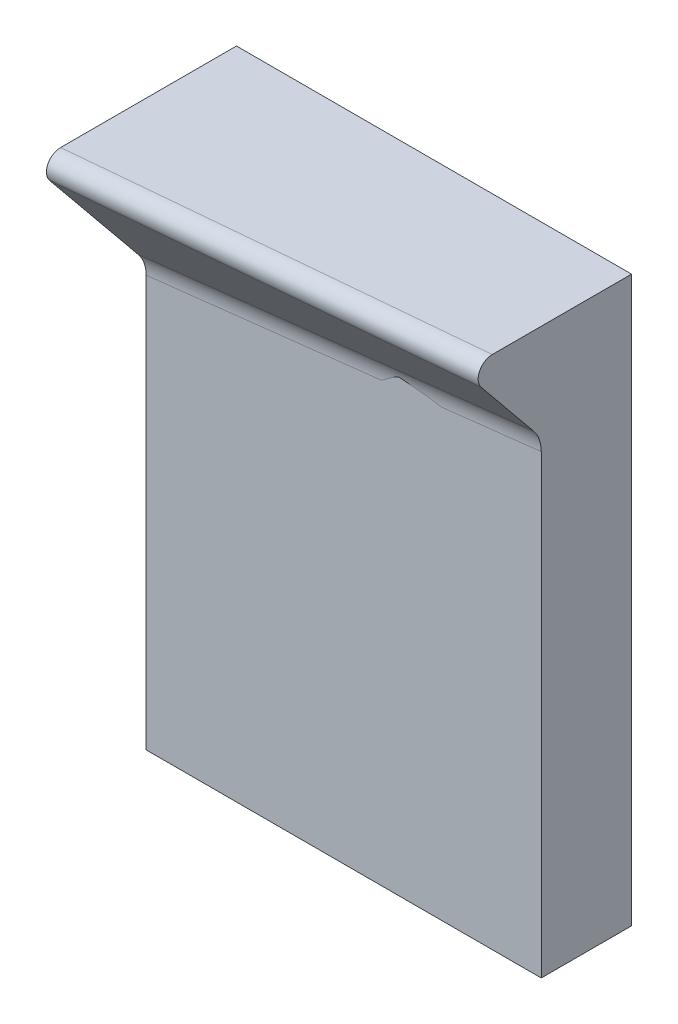
ISO-10303-21;
HEADER;
FILE_DESCRIPTION(('STEP AP214'),'2;1');
FILE_NAME('part.step','',(''),(''),'','','');
FILE_SCHEMA(('AUTOMOTIVE_DESIGN { 1 0 10303 214 1 1 1 1 }'));
ENDSEC;
DATA;
#1=APPLICATION_CONTEXT('core data for automotive mechanical design processes');
#2=APPLICATION_PROTOCOL_DEFINITION('international standard','automotive_design',2000,#1);
#3=PRODUCT_CONTEXT('',#1,'mechanical');
#4=PRODUCT('Part','Part','',(#3));
#5=PRODUCT_RELATED_PRODUCT_CATEGORY('part','',(#4));
#6=PRODUCT_DEFINITION_FORMATION('','',#4);
#7=PRODUCT_DEFINITION_CONTEXT('part definition',#1,'design');
#8=PRODUCT_DEFINITION('design','',#6,#7);
#9=PRODUCT_DEFINITION_SHAPE('','',#8);
#10=(LENGTH_UNIT() NAMED_UNIT(*) SI_UNIT(.MILLI.,.METRE.));
#11=(NAMED_UNIT(*) PLANE_ANGLE_UNIT() SI_UNIT($,.RADIAN.));
#12=(NAMED_UNIT(*) SI_UNIT($,.STERADIAN.) SOLID_ANGLE_UNIT());
#13=UNCERTAINTY_MEASURE_WITH_UNIT(LENGTH_MEASURE(1.E-05),#10,'distance_accuracy_value','');
#14=(GEOMETRIC_REPRESENTATION_CONTEXT(3) GLOBAL_UNCERTAINTY_ASSIGNED_CONTEXT((#13)) GLOBAL_UNIT_ASSIGNED_CONTEXT((#10,
#11,#12)) REPRESENTATION_CONTEXT('',''));
#15=CARTESIAN_POINT('',(0.,0.,0.));
#16=DIRECTION('',(0.,0.,1.));
#17=DIRECTION('',(1.,0.,0.));
#18=AXIS2_PLACEMENT_3D('',#15,#16,#17);
#19=CARTESIAN_POINT('',(-33.1458358214164,49.8380627497857,44.));
#20=DIRECTION('',(-0.993631308587486,-0.112680178357692,0.));
#21=DIRECTION('',(-0.0715823175561208,0.631223990782389,-0.772290259730142));
#22=AXIS2_PLACEMENT_3D('',#19,#20,#21);
#23=CYLINDRICAL_SURFACE('',#22,12.);
#24=CARTESIAN_POINT('',(13.3705485885876,55.1131325332905,44.));
#25=DIRECTION('',(0.588639923655362,-0.808395348996399,0.));
#26=DIRECTION('',(-0.808395348996399,-0.588639923655362,0.));
#27=AXIS2_PLACEMENT_3D('',#24,#25,#26);
#28=ELLIPSE('',#27,24.3012910260578,12.);
#29=CARTESIAN_POINT('',(13.3705485885876,55.1131325332905,32.));
#30=VERTEX_POINT('',#29);
#31=CARTESIAN_POINT('',(19.2154916356902,59.3691773426622,32.5434410649574));
#32=VERTEX_POINT('',#31);
#33=EDGE_CURVE('E400',#30,#32,#28,.T.);
#34=ORIENTED_EDGE('',*,*,#33,.T.);
#35=CARTESIAN_POINT('',(19.2154916356902,59.3691773426622,32.5434410649574));
#36=CARTESIAN_POINT('',(19.2588992136403,59.4007835589087,32.551704639562));
#37=CARTESIAN_POINT('',(19.3036206998502,59.4306722230316,32.5594894096215));
#38=CARTESIAN_POINT('',(19.3954623281207,59.4868250412178,32.5739747576308));
#39=CARTESIAN_POINT('',(19.4425829390899,59.5130884829807,32.5806751225562));
#40=CARTESIAN_POINT('',(19.5871638011007,59.5861343603002,32.5989538535357));
#41=CARTESIAN_POINT('',(19.6878516262102,59.627178578181,32.6087115147425));
#42=CARTESIAN_POINT('',(19.8950370091105,59.6925157683977,32.6225674538925));
#43=CARTESIAN_POINT('',(20.0015446308321,59.7167786644237,32.6266555837304));
#44=CARTESIAN_POINT('',(20.2170168154206,59.7476072457473,32.6287945546066));
#45=CARTESIAN_POINT('',(20.3259760905863,59.7542079094488,32.6268573447545));
#46=CARTESIAN_POINT('',(20.4794342945246,59.7510169246153,32.6200014768146));
#47=CARTESIAN_POINT('',(20.5243054399134,59.7485625254239,32.6174939619154));
#48=CARTESIAN_POINT('',(20.6136646640917,59.740654906745,32.6115253121886));
#49=CARTESIAN_POINT('',(20.6581531380731,59.735205290756,32.6080653257564));
#50=CARTESIAN_POINT('',(20.7023900206614,59.7282753968863,32.6041486244638));
#51=B_SPLINE_CURVE_WITH_KNOTS('',3,(#35,#36,#37,#38,#39,#40,#41,#42,#43,#44,#45,#46,#47,#48,#49,
#50),.UNSPECIFIED.,.F.,.F.,(4,2,2,2,2,2,2,4),(0.,0.162889911327305,0.325811782595996,
0.651623807538152,0.978018266127138,1.30376585086446,1.43870075471509,1.57347367471043),.UNSPECIFIED.);
#52=CARTESIAN_POINT('',(20.7023900206614,59.7282753968863,32.6041486244638));
#53=VERTEX_POINT('',#52);
#54=EDGE_CURVE('E395',#32,#53,#51,.T.);
#55=ORIENTED_EDGE('',*,*,#54,.T.);
#56=CARTESIAN_POINT('',(34.7108448785115,57.5331734190522,44.));
#57=DIRECTION('',(-0.154809268830271,-0.987944376108411,0.));
#58=DIRECTION('',(-0.987944376108411,0.154809268830271,0.));
#59=AXIS2_PLACEMENT_3D('',#56,#57,#58);
#60=ELLIPSE('',#59,45.2582404293174,12.);
#61=CARTESIAN_POINT('',(34.7108448785116,57.5331734190522,32.));
#62=VERTEX_POINT('',#61);
#63=EDGE_CURVE('E388',#53,#62,#60,.T.);
#64=ORIENTED_EDGE('',*,*,#63,.T.);
#65=DIRECTION('',(-0.993631308587485,-0.112680178357692,0.));
#66=VECTOR('',#65,1.);
#67=CARTESIAN_POINT('',(-197.34531821805,31.2174468303908,32.));
#68=LINE('',#67,#66);
#69=CARTESIAN_POINT('',(70.,61.5350484191811,32.));
#70=VERTEX_POINT('',#69);
#71=EDGE_CURVE('E393',#70,#62,#68,.T.);
#72=ORIENTED_EDGE('',*,*,#71,.F.);
#73=CARTESIAN_POINT('',(70.,61.535048419181,44.));
#74=DIRECTION('',(-1.,0.,0.));
#75=DIRECTION('',(0.,-1.,0.));
#76=AXIS2_PLACEMENT_3D('',#73,#74,#75);
#77=ELLIPSE('',#76,12.0769141393691,12.);
#78=CARTESIAN_POINT('',(70.,69.2071475906793,34.7325168832384));
#79=VERTEX_POINT('',#78);
#80=EDGE_CURVE('E500',#79,#70,#77,.T.);
#81=ORIENTED_EDGE('',*,*,#80,.F.);
#82=CARTESIAN_POINT('',(-8.05017494246018,60.3560701765953,34.7325168832383));
#83=DIRECTION('',(0.993631308587486,0.112680178357691,0.));
#84=VECTOR('',#83,1.);
#85=LINE('',#82,#84);
#86=CARTESIAN_POINT('',(-8.05017494246019,60.3560701765953,34.7325168832383));
#87=VERTEX_POINT('',#86);
#88=EDGE_CURVE('E424',#87,#79,#85,.T.);
#89=ORIENTED_EDGE('',*,*,#88,.F.);
#90=DIRECTION('',(-0.993631308587485,-0.112680178357691,0.));
#91=VECTOR('',#90,1.);
#92=CARTESIAN_POINT('',(-7.39257340191082,60.4306437716874,34.7325168832383));
#93=LINE('',#92,#91);
#94=CARTESIAN_POINT('',(-33.6951462841346,57.4478687946706,34.7325168832383));
#95=VERTEX_POINT('',#94);
#96=EDGE_CURVE('E566',#87,#95,#93,.T.);
#97=ORIENTED_EDGE('',*,*,#96,.T.);
#98=CARTESIAN_POINT('',(-70.,53.3308111329419,34.7325168832383));
#99=DIRECTION('',(0.993631308587485,0.112680178357692,0.));
#100=VECTOR('',#99,1.);
#101=LINE('',#98,#100);
#102=CARTESIAN_POINT('',(-70.,53.3308111329419,34.7325168832383));
#103=VERTEX_POINT('',#102);
#104=EDGE_CURVE('E544',#103,#95,#101,.T.);
#105=ORIENTED_EDGE('',*,*,#104,.F.);
#106=CARTESIAN_POINT('',(-70.,45.6587119614436,44.));
#107=DIRECTION('',(1.,0.,0.));
#108=DIRECTION('',(0.,-1.,0.));
#109=AXIS2_PLACEMENT_3D('',#106,#107,#108);
#110=ELLIPSE('',#109,12.0769141393691,12.);
#111=CARTESIAN_POINT('',(-70.,45.6587119614437,32.));
#112=VERTEX_POINT('',#111);
#113=EDGE_CURVE('E524',#112,#103,#110,.T.);
#114=ORIENTED_EDGE('',*,*,#113,.F.);
#115=EDGE_CURVE('E415',#30,#112,#68,.T.);
#116=ORIENTED_EDGE('',*,*,#115,.F.);
#117=EDGE_LOOP('',(#34,#55,#64,#72,#81,#89,#97,#105,#114,#116));
#118=FACE_BOUND('',#117,.T.);
#119=ADVANCED_FACE('F306',(#118),#23,.F.);
#120=CARTESIAN_POINT('',(70.,100.,80.));
#121=DIRECTION('',(-1.,0.,0.));
#122=DIRECTION('',(0.,-1.,0.));
#123=AXIS2_PLACEMENT_3D('',#120,#121,#122);
#124=PLANE('',#123);
#125=DIRECTION('',(0.,0.,-1.));
#126=VECTOR('',#125,1.);
#127=CARTESIAN_POINT('',(70.,100.,80.));
#128=LINE('',#127,#126);
#129=CARTESIAN_POINT('',(70.,100.,49.3398061625496));
#130=VERTEX_POINT('',#129);
#131=CARTESIAN_POINT('',(70.,100.,0.));
#132=VERTEX_POINT('',#131);
#133=EDGE_CURVE('E518',#130,#132,#128,.T.);
#134=ORIENTED_EDGE('',*,*,#133,.F.);
#135=CARTESIAN_POINT('',(70.,95.,49.3398061625496));
#136=DIRECTION('',(-1.,0.,0.));
#137=DIRECTION('',(0.,0.,-1.));
#138=AXIS2_PLACEMENT_3D('',#135,#136,#137);
#139=ELLIPSE('',#138,5.02143189753817,5.);
#140=CARTESIAN_POINT('',(70.,91.8438800460881,53.2344316992678));
#141=VERTEX_POINT('',#140);
#142=EDGE_CURVE('E328',#130,#141,#139,.F.);
#143=ORIENTED_EDGE('',*,*,#142,.T.);
#144=DIRECTION('',(0.,-0.774276514747531,-0.632847437152444));
#145=VECTOR('',#144,1.);
#146=CARTESIAN_POINT('',(70.,109.848606811691,67.9504213660303));
#147=LINE('',#146,#145);
#148=EDGE_CURVE('E504',#141,#79,#147,.T.);
#149=ORIENTED_EDGE('',*,*,#148,.T.);
#150=ORIENTED_EDGE('',*,*,#80,.T.);
#151=DIRECTION('',(0.,1.,0.));
#152=VECTOR('',#151,1.);
#153=CARTESIAN_POINT('',(70.,100.,32.));
#154=LINE('',#153,#152);
#155=CARTESIAN_POINT('',(70.,-100.,32.));
#156=VERTEX_POINT('',#155);
#157=EDGE_CURVE('E412',#156,#70,#154,.T.);
#158=ORIENTED_EDGE('',*,*,#157,.F.);
#159=DIRECTION('',(0.,0.,-1.));
#160=VECTOR('',#159,1.);
#161=CARTESIAN_POINT('',(70.,-100.,80.));
#162=LINE('',#161,#160);
#163=CARTESIAN_POINT('',(70.,-100.,0.));
#164=VERTEX_POINT('',#163);
#165=EDGE_CURVE('E512',#156,#164,#162,.T.);
#166=ORIENTED_EDGE('',*,*,#165,.T.);
#167=DIRECTION('',(0.,1.,0.));
#168=VECTOR('',#167,1.);
#169=CARTESIAN_POINT('',(70.,100.,0.));
#170=LINE('',#169,#168);
#171=EDGE_CURVE('E494',#164,#132,#170,.T.);
#172=ORIENTED_EDGE('',*,*,#171,.T.);
#173=EDGE_LOOP('',(#134,#143,#149,#150,#158,#166,#172));
#174=FACE_BOUND('',#173,.T.);
#175=ADVANCED_FACE('F443',(#174),#124,.F.);
#176=CARTESIAN_POINT('',(-70.,100.,80.));
#177=DIRECTION('',(1.,0.,0.));
#178=DIRECTION('',(0.,1.,0.));
#179=AXIS2_PLACEMENT_3D('',#176,#177,#178);
#180=PLANE('',#179);
#181=DIRECTION('',(0.,0.774276514747531,0.632847437152444));
#182=VECTOR('',#181,1.);
#183=CARTESIAN_POINT('',(-70.,103.490199491347,75.7298088934464));
#184=LINE('',#183,#182);
#185=CARTESIAN_POINT('',(-70.,91.8438800460881,66.210802087985));
#186=VERTEX_POINT('',#185);
#187=EDGE_CURVE('E522',#103,#186,#184,.T.);
#188=ORIENTED_EDGE('',*,*,#187,.T.);
#189=CARTESIAN_POINT('',(-70.,95.,62.3161765512667));
#190=DIRECTION('',(1.,0.,0.));
#191=DIRECTION('',(0.,0.,-1.));
#192=AXIS2_PLACEMENT_3D('',#189,#190,#191);
#193=ELLIPSE('',#192,5.02143189753817,5.);
#194=CARTESIAN_POINT('',(-70.,100.,62.3161765512667));
#195=VERTEX_POINT('',#194);
#196=EDGE_CURVE('E54',#186,#195,#193,.F.);
#197=ORIENTED_EDGE('',*,*,#196,.T.);
#198=DIRECTION('',(0.,0.,-1.));
#199=VECTOR('',#198,1.);
#200=CARTESIAN_POINT('',(-70.,100.,80.));
#201=LINE('',#200,#199);
#202=CARTESIAN_POINT('',(-70.,100.,0.));
#203=VERTEX_POINT('',#202);
#204=EDGE_CURVE('E516',#195,#203,#201,.T.);
#205=ORIENTED_EDGE('',*,*,#204,.T.);
#206=DIRECTION('',(0.,-1.,0.));
#207=VECTOR('',#206,1.);
#208=CARTESIAN_POINT('',(-70.,100.,0.));
#209=LINE('',#208,#207);
#210=CARTESIAN_POINT('',(-70.,-100.,0.));
#211=VERTEX_POINT('',#210);
#212=EDGE_CURVE('E502',#203,#211,#209,.T.);
#213=ORIENTED_EDGE('',*,*,#212,.T.);
#214=DIRECTION('',(0.,0.,-1.));
#215=VECTOR('',#214,1.);
#216=CARTESIAN_POINT('',(-70.,-100.,80.));
#217=LINE('',#216,#215);
#218=CARTESIAN_POINT('',(-70.,-100.,32.));
#219=VERTEX_POINT('',#218);
#220=EDGE_CURVE('E514',#219,#211,#217,.T.);
#221=ORIENTED_EDGE('',*,*,#220,.F.);
#222=DIRECTION('',(0.,-1.,0.));
#223=VECTOR('',#222,1.);
#224=CARTESIAN_POINT('',(-70.,100.,32.));
#225=LINE('',#224,#223);
#226=EDGE_CURVE('E414',#112,#219,#225,.T.);
#227=ORIENTED_EDGE('',*,*,#226,.F.);
#228=ORIENTED_EDGE('',*,*,#113,.T.);
#229=EDGE_LOOP('',(#188,#197,#205,#213,#221,#227,#228));
#230=FACE_BOUND('',#229,.T.);
#231=ADVANCED_FACE('F471',(#230),#180,.F.);
#232=CARTESIAN_POINT('',(-70.,-100.,80.));
#233=DIRECTION('',(0.,1.,0.));
#234=DIRECTION('',(0.,0.,1.));
#235=AXIS2_PLACEMENT_3D('',#232,#233,#234);
#236=PLANE('',#235);
#237=DIRECTION('',(1.,0.,0.));
#238=VECTOR('',#237,1.);
#239=CARTESIAN_POINT('',(-70.,-100.,32.));
#240=LINE('',#239,#238);
#241=EDGE_CURVE('E520',#219,#156,#240,.T.);
#242=ORIENTED_EDGE('',*,*,#241,.F.);
#243=ORIENTED_EDGE('',*,*,#220,.T.);
#244=DIRECTION('',(1.,0.,0.));
#245=VECTOR('',#244,1.);
#246=CARTESIAN_POINT('',(-70.,-100.,0.));
#247=LINE('',#246,#245);
#248=EDGE_CURVE('E497',#211,#164,#247,.T.);
#249=ORIENTED_EDGE('',*,*,#248,.T.);
#250=ORIENTED_EDGE('',*,*,#165,.F.);
#251=EDGE_LOOP('',(#242,#243,#249,#250));
#252=FACE_BOUND('',#251,.T.);
#253=ADVANCED_FACE('F476',(#252),#236,.F.);
#254=CARTESIAN_POINT('',(-70.,100.,80.));
#255=DIRECTION('',(0.,-1.,0.));
#256=DIRECTION('',(0.,0.,-1.));
#257=AXIS2_PLACEMENT_3D('',#254,#255,#256);
#258=PLANE('',#257);
#259=ORIENTED_EDGE('',*,*,#204,.F.);
#260=DIRECTION('',(0.995731915123917,0.,-0.0922927581322473));
#261=VECTOR('',#260,1.);
#262=CARTESIAN_POINT('',(-71.6251229467111,100.,62.4668065318648));
#263=LINE('',#262,#261);
#264=EDGE_CURVE('E459',#195,#130,#263,.T.);
#265=ORIENTED_EDGE('',*,*,#264,.T.);
#266=ORIENTED_EDGE('',*,*,#133,.T.);
#267=DIRECTION('',(-1.,0.,0.));
#268=VECTOR('',#267,1.);
#269=CARTESIAN_POINT('',(-70.,100.,0.));
#270=LINE('',#269,#268);
#271=EDGE_CURVE('E499',#132,#203,#270,.T.);
#272=ORIENTED_EDGE('',*,*,#271,.T.);
#273=EDGE_LOOP('',(#259,#265,#266,#272));
#274=FACE_BOUND('',#273,.T.);
#275=ADVANCED_FACE('F472',(#274),#258,.F.);
#276=CARTESIAN_POINT('',(0.,0.,0.));
#277=DIRECTION('',(0.,0.,1.));
#278=DIRECTION('',(1.,0.,0.));
#279=AXIS2_PLACEMENT_3D('',#276,#277,#278);
#280=PLANE('',#279);
#281=ORIENTED_EDGE('',*,*,#171,.F.);
#282=ORIENTED_EDGE('',*,*,#248,.F.);
#283=ORIENTED_EDGE('',*,*,#212,.F.);
#284=ORIENTED_EDGE('',*,*,#271,.F.);
#285=EDGE_LOOP('',(#281,#282,#283,#284));
#286=FACE_BOUND('',#285,.T.);
#287=ADVANCED_FACE('F475',(#286),#280,.F.);
#288=CARTESIAN_POINT('',(-0.848312394564267,7.48055041256812,-9.15230774718494));
#289=DIRECTION('',(-0.0715823175561207,0.631223990782389,-0.772290259730142));
#290=DIRECTION('',(0.,0.774276514747531,0.632847437152444));
#291=AXIS2_PLACEMENT_3D('',#288,#289,#290);
#292=PLANE('',#291);
#293=ORIENTED_EDGE('',*,*,#148,.F.);
#294=DIRECTION('',(0.995731915123917,0.,-0.0922927581322473));
#295=VECTOR('',#294,1.);
#296=CARTESIAN_POINT('',(5.48843950138072,91.8438800460881,59.2139024377265));
#297=LINE('',#296,#295);
#298=EDGE_CURVE('E314',#141,#186,#297,.F.);
#299=ORIENTED_EDGE('',*,*,#298,.T.);
#300=ORIENTED_EDGE('',*,*,#187,.F.);
#301=ORIENTED_EDGE('',*,*,#104,.T.);
#302=ORIENTED_EDGE('',*,*,#96,.F.);
#303=ORIENTED_EDGE('',*,*,#88,.T.);
#304=EDGE_LOOP('',(#293,#299,#300,#301,#302,#303));
#305=FACE_BOUND('',#304,.T.);
#306=ADVANCED_FACE('F445',(#305),#292,.F.);
#307=CARTESIAN_POINT('',(0.,0.,32.));
#308=DIRECTION('',(0.,0.,1.));
#309=DIRECTION('',(1.,0.,0.));
#310=AXIS2_PLACEMENT_3D('',#307,#308,#309);
#311=PLANE('',#310);
#312=DIRECTION('',(-0.987944376108411,0.154809268830271,0.));
#313=VECTOR('',#312,1.);
#314=CARTESIAN_POINT('',(19.884631065188,59.8564168884902,32.));
#315=LINE('',#314,#313);
#316=CARTESIAN_POINT('',(20.7023900206614,59.7282753968863,32.));
#317=VERTEX_POINT('',#316);
#318=EDGE_CURVE('E399',#62,#317,#315,.T.);
#319=ORIENTED_EDGE('',*,*,#318,.T.);
#320=CARTESIAN_POINT('',(20.3927714830009,57.7523866446694,32.));
#321=DIRECTION('',(0.,0.,1.));
#322=DIRECTION('',(1.,0.,0.));
#323=AXIS2_PLACEMENT_3D('',#320,#321,#322);
#324=CIRCLE('',#323,2.);
#325=CARTESIAN_POINT('',(19.2154916356902,59.3691773426622,32.));
#326=VERTEX_POINT('',#325);
#327=EDGE_CURVE('E530',#317,#326,#324,.T.);
#328=ORIENTED_EDGE('',*,*,#327,.T.);
#329=DIRECTION('',(-0.808395348996399,-0.588639923655362,0.));
#330=VECTOR('',#329,1.);
#331=CARTESIAN_POINT('',(7.46738137476122,50.8146913035314,32.));
#332=LINE('',#331,#330);
#333=EDGE_CURVE('E406',#326,#30,#332,.T.);
#334=ORIENTED_EDGE('',*,*,#333,.T.);
#335=ORIENTED_EDGE('',*,*,#115,.T.);
#336=ORIENTED_EDGE('',*,*,#226,.T.);
#337=ORIENTED_EDGE('',*,*,#241,.T.);
#338=ORIENTED_EDGE('',*,*,#157,.T.);
#339=ORIENTED_EDGE('',*,*,#71,.T.);
#340=EDGE_LOOP('',(#319,#328,#334,#335,#336,#337,#338,#339));
#341=FACE_BOUND('',#340,.T.);
#342=ADVANCED_FACE('F409',(#341),#311,.T.);
#343=CARTESIAN_POINT('',(19.884631065188,59.8564168884902,72.8781530214586));
#344=DIRECTION('',(-0.154809268830271,-0.987944376108411,0.));
#345=DIRECTION('',(0.987944376108411,-0.154809268830271,0.));
#346=AXIS2_PLACEMENT_3D('',#343,#344,#345);
#347=PLANE('',#346);
#348=ORIENTED_EDGE('',*,*,#63,.F.);
#349=DIRECTION('',(0.,0.,-1.));
#350=VECTOR('',#349,1.);
#351=CARTESIAN_POINT('',(20.7023900206614,59.7282753968863,32.));
#352=LINE('',#351,#350);
#353=EDGE_CURVE('E404',#53,#317,#352,.T.);
#354=ORIENTED_EDGE('',*,*,#353,.T.);
#355=ORIENTED_EDGE('',*,*,#318,.F.);
#356=EDGE_LOOP('',(#348,#354,#355));
#357=FACE_BOUND('',#356,.T.);
#358=ADVANCED_FACE('F403',(#357),#347,.T.);
#359=CARTESIAN_POINT('',(7.46738137476122,50.8146913035314,72.8781530214586));
#360=DIRECTION('',(0.588639923655362,-0.808395348996399,0.));
#361=DIRECTION('',(0.808395348996399,0.588639923655362,0.));
#362=AXIS2_PLACEMENT_3D('',#359,#360,#361);
#363=PLANE('',#362);
#364=ORIENTED_EDGE('',*,*,#333,.F.);
#365=DIRECTION('',(0.,0.,-1.));
#366=VECTOR('',#365,1.);
#367=CARTESIAN_POINT('',(19.2154916356902,59.3691773426622,32.6789126440403));
#368=LINE('',#367,#366);
#369=EDGE_CURVE('E460',#326,#32,#368,.F.);
#370=ORIENTED_EDGE('',*,*,#369,.T.);
#371=ORIENTED_EDGE('',*,*,#33,.F.);
#372=EDGE_LOOP('',(#364,#370,#371));
#373=FACE_BOUND('',#372,.T.);
#374=ADVANCED_FACE('F467',(#373),#363,.T.);
#375=CARTESIAN_POINT('',(20.3927714830009,57.7523866446694,72.8781530214586));
#376=DIRECTION('',(0.,0.,1.));
#377=DIRECTION('',(1.,0.,0.));
#378=AXIS2_PLACEMENT_3D('',#375,#376,#377);
#379=CYLINDRICAL_SURFACE('',#378,2.);
#380=ORIENTED_EDGE('',*,*,#54,.F.);
#381=ORIENTED_EDGE('',*,*,#369,.F.);
#382=ORIENTED_EDGE('',*,*,#327,.F.);
#383=ORIENTED_EDGE('',*,*,#353,.F.);
#384=EDGE_LOOP('',(#380,#381,#382,#383));
#385=FACE_BOUND('',#384,.T.);
#386=ADVANCED_FACE('F463',(#385),#379,.F.);
#387=CARTESIAN_POINT('',(-71.6251229467111,95.,62.4668065318648));
#388=DIRECTION('',(0.995731915123917,0.,-0.0922927581322473));
#389=DIRECTION('',(-0.0922927581322473,0.,-0.995731915123917));
#390=AXIS2_PLACEMENT_3D('',#387,#388,#389);
#391=CYLINDRICAL_SURFACE('',#390,5.);
#392=ORIENTED_EDGE('',*,*,#196,.F.);
#393=ORIENTED_EDGE('',*,*,#298,.F.);
#394=ORIENTED_EDGE('',*,*,#142,.F.);
#395=ORIENTED_EDGE('',*,*,#264,.F.);
#396=EDGE_LOOP('',(#392,#393,#394,#395));
#397=FACE_BOUND('',#396,.T.);
#398=ADVANCED_FACE('F308',(#397),#391,.T.);
#399=CLOSED_SHELL('',(#119,#175,#231,#253,#275,#287,#306,#342,#358,#374,#386,#398));
#400=MANIFOLD_SOLID_BREP('B6',#399);
#401=ADVANCED_BREP_SHAPE_REPRESENTATION('',(#18,#400),#14);
#402=SHAPE_DEFINITION_REPRESENTATION(#9,#401);
ENDSEC;
END-ISO-10303-21;
